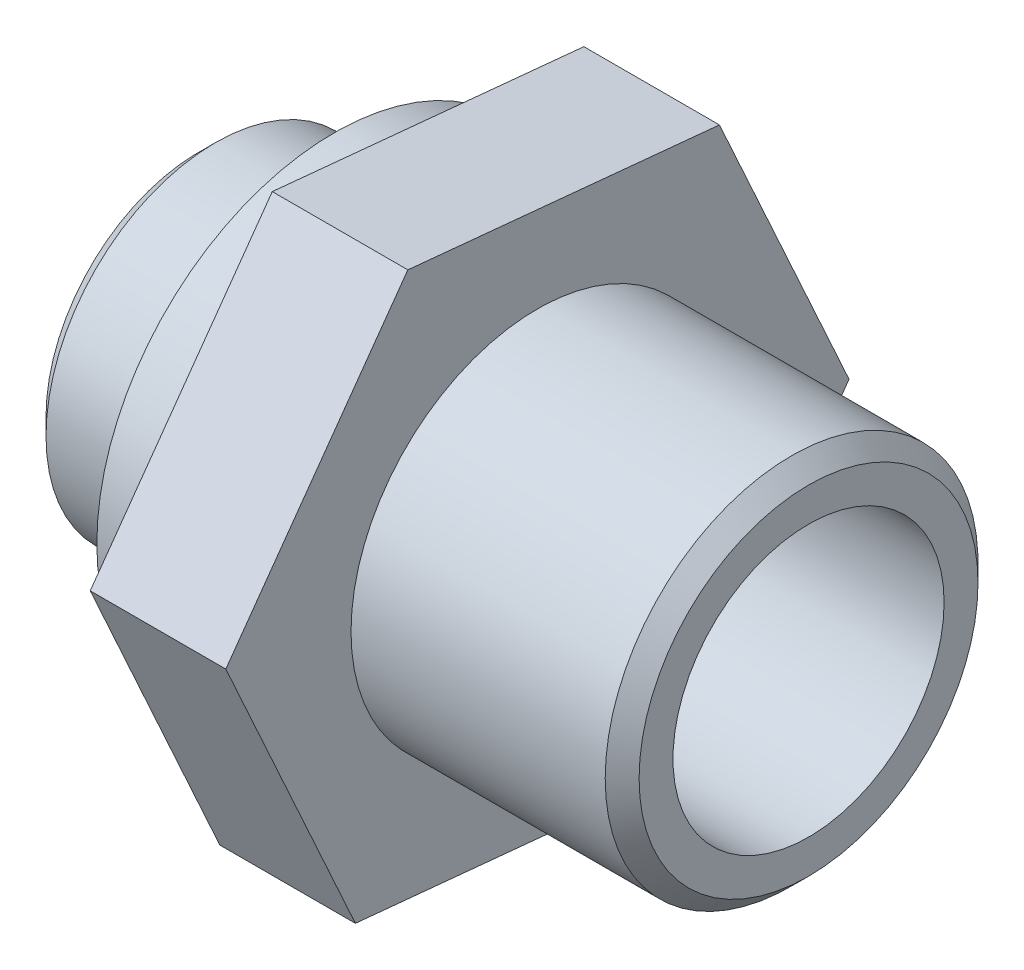
ISO-10303-21;
HEADER;
FILE_DESCRIPTION(('STEP AP214'),'2;1');
FILE_NAME('part.step','',(''),(''),'','','');
FILE_SCHEMA(('AUTOMOTIVE_DESIGN { 1 0 10303 214 1 1 1 1 }'));
ENDSEC;
DATA;
#1=APPLICATION_CONTEXT('core data for automotive mechanical design processes');
#2=APPLICATION_PROTOCOL_DEFINITION('international standard','automotive_design',2000,#1);
#3=PRODUCT_CONTEXT('',#1,'mechanical');
#4=PRODUCT('Part','Part','',(#3));
#5=PRODUCT_RELATED_PRODUCT_CATEGORY('part','',(#4));
#6=PRODUCT_DEFINITION_FORMATION('','',#4);
#7=PRODUCT_DEFINITION_CONTEXT('part definition',#1,'design');
#8=PRODUCT_DEFINITION('design','',#6,#7);
#9=PRODUCT_DEFINITION_SHAPE('','',#8);
#10=(LENGTH_UNIT() NAMED_UNIT(*) SI_UNIT(.MILLI.,.METRE.));
#11=(NAMED_UNIT(*) PLANE_ANGLE_UNIT() SI_UNIT($,.RADIAN.));
#12=(NAMED_UNIT(*) SI_UNIT($,.STERADIAN.) SOLID_ANGLE_UNIT());
#13=UNCERTAINTY_MEASURE_WITH_UNIT(LENGTH_MEASURE(1.E-05),#10,'distance_accuracy_value','');
#14=(GEOMETRIC_REPRESENTATION_CONTEXT(3) GLOBAL_UNCERTAINTY_ASSIGNED_CONTEXT((#13)) GLOBAL_UNIT_ASSIGNED_CONTEXT((#10,
#11,#12)) REPRESENTATION_CONTEXT('',''));
#15=CARTESIAN_POINT('',(0.,0.,0.));
#16=DIRECTION('',(0.,0.,1.));
#17=DIRECTION('',(1.,0.,0.));
#18=AXIS2_PLACEMENT_3D('',#15,#16,#17);
#19=CARTESIAN_POINT('',(-2.5,-2.5,0.));
#20=DIRECTION('',(-1.,0.,0.));
#21=DIRECTION('',(0.,0.,1.));
#22=AXIS2_PLACEMENT_3D('',#19,#20,#21);
#23=PLANE('',#22);
#24=CARTESIAN_POINT('',(-2.5,0.,0.));
#25=DIRECTION('',(-1.,0.,0.));
#26=DIRECTION('',(0.,0.,1.));
#27=AXIS2_PLACEMENT_3D('',#24,#25,#26);
#28=CIRCLE('',#27,3.5);
#29=CARTESIAN_POINT('',(-2.5,0.,3.5));
#30=VERTEX_POINT('',#29);
#31=EDGE_CURVE('E11',#30,#30,#28,.T.);
#32=ORIENTED_EDGE('',*,*,#31,.T.);
#33=EDGE_LOOP('',(#32));
#34=FACE_BOUND('',#33,.T.);
#35=CARTESIAN_POINT('',(-2.5,0.,0.));
#36=DIRECTION('',(-1.,0.,0.));
#37=DIRECTION('',(0.,0.,1.));
#38=AXIS2_PLACEMENT_3D('',#35,#36,#37);
#39=CIRCLE('',#38,2.5);
#40=CARTESIAN_POINT('',(-2.5,0.,2.5));
#41=VERTEX_POINT('',#40);
#42=EDGE_CURVE('E166',#41,#41,#39,.T.);
#43=ORIENTED_EDGE('',*,*,#42,.F.);
#44=EDGE_LOOP('',(#43));
#45=FACE_BOUND('',#44,.T.);
#46=ADVANCED_FACE('F44',(#34,#45),#23,.T.);
#47=CARTESIAN_POINT('',(-4.5,0.,0.));
#48=DIRECTION('',(-1.,0.,0.));
#49=DIRECTION('',(0.,0.,1.));
#50=AXIS2_PLACEMENT_3D('',#47,#48,#49);
#51=CYLINDRICAL_SURFACE('',#50,3.5);
#52=CARTESIAN_POINT('',(-1.5,0.,0.));
#53=DIRECTION('',(-1.,0.,0.));
#54=DIRECTION('',(0.,0.,1.));
#55=AXIS2_PLACEMENT_3D('',#52,#53,#54);
#56=CIRCLE('',#55,3.5);
#57=CARTESIAN_POINT('',(-1.5,0.,3.5));
#58=VERTEX_POINT('',#57);
#59=EDGE_CURVE('E165',#58,#58,#56,.T.);
#60=ORIENTED_EDGE('',*,*,#59,.T.);
#61=EDGE_LOOP('',(#60));
#62=FACE_BOUND('',#61,.T.);
#63=ORIENTED_EDGE('',*,*,#31,.F.);
#64=EDGE_LOOP('',(#63));
#65=FACE_BOUND('',#64,.T.);
#66=ADVANCED_FACE('F180',(#62,#65),#51,.T.);
#67=CARTESIAN_POINT('',(-4.5,0.,0.));
#68=DIRECTION('',(-1.,0.,0.));
#69=DIRECTION('',(0.,0.,1.));
#70=AXIS2_PLACEMENT_3D('',#67,#68,#69);
#71=PLANE('',#70);
#72=CARTESIAN_POINT('',(-4.5,0.,0.));
#73=DIRECTION('',(-1.,0.,0.));
#74=DIRECTION('',(0.,0.,1.));
#75=AXIS2_PLACEMENT_3D('',#72,#73,#74);
#76=CIRCLE('',#75,2.);
#77=CARTESIAN_POINT('',(-4.5,0.,2.));
#78=VERTEX_POINT('',#77);
#79=EDGE_CURVE('E424',#78,#78,#76,.T.);
#80=ORIENTED_EDGE('',*,*,#79,.F.);
#81=EDGE_LOOP('',(#80));
#82=FACE_BOUND('',#81,.T.);
#83=CARTESIAN_POINT('',(-4.5,0.,0.));
#84=DIRECTION('',(-1.,0.,0.));
#85=DIRECTION('',(0.,0.,1.));
#86=AXIS2_PLACEMENT_3D('',#83,#84,#85);
#87=CIRCLE('',#86,2.25);
#88=CARTESIAN_POINT('',(-4.5,0.,2.25));
#89=VERTEX_POINT('',#88);
#90=EDGE_CURVE('E53',#89,#89,#87,.T.);
#91=ORIENTED_EDGE('',*,*,#90,.T.);
#92=EDGE_LOOP('',(#91));
#93=FACE_BOUND('',#92,.T.);
#94=ADVANCED_FACE('F209',(#82,#93),#71,.T.);
#95=CARTESIAN_POINT('',(-4.5,0.,0.));
#96=DIRECTION('',(1.,0.,0.));
#97=DIRECTION('',(0.,0.,-1.));
#98=AXIS2_PLACEMENT_3D('',#95,#96,#97);
#99=CONICAL_SURFACE('',#98,2.25,0.785398163397446);
#100=CARTESIAN_POINT('',(-4.25,0.,0.));
#101=DIRECTION('',(-1.,0.,0.));
#102=DIRECTION('',(0.,0.,1.));
#103=AXIS2_PLACEMENT_3D('',#100,#101,#102);
#104=CIRCLE('',#103,2.5);
#105=CARTESIAN_POINT('',(-4.25,0.,2.5));
#106=VERTEX_POINT('',#105);
#107=EDGE_CURVE('E170',#106,#106,#104,.T.);
#108=ORIENTED_EDGE('',*,*,#107,.T.);
#109=EDGE_LOOP('',(#108));
#110=FACE_BOUND('',#109,.T.);
#111=ORIENTED_EDGE('',*,*,#90,.F.);
#112=EDGE_LOOP('',(#111));
#113=FACE_BOUND('',#112,.T.);
#114=ADVANCED_FACE('F217',(#110,#113),#99,.T.);
#115=CARTESIAN_POINT('',(-4.5,0.,0.));
#116=DIRECTION('',(-1.,0.,0.));
#117=DIRECTION('',(0.,0.,1.));
#118=AXIS2_PLACEMENT_3D('',#115,#116,#117);
#119=CYLINDRICAL_SURFACE('',#118,2.5);
#120=ORIENTED_EDGE('',*,*,#42,.T.);
#121=EDGE_LOOP('',(#120));
#122=FACE_BOUND('',#121,.T.);
#123=ORIENTED_EDGE('',*,*,#107,.F.);
#124=EDGE_LOOP('',(#123));
#125=FACE_BOUND('',#124,.T.);
#126=ADVANCED_FACE('F214',(#122,#125),#119,.T.);
#127=CARTESIAN_POINT('',(0.5,-3.75789570482405,2.68543352272929));
#128=DIRECTION('',(0.,0.995312151011748,-0.0967146423679853));
#129=DIRECTION('',(0.,0.0967146423679853,0.995312151011748));
#130=AXIS2_PLACEMENT_3D('',#127,#128,#129);
#131=PLANE('',#130);
#132=DIRECTION('',(0.,-0.0967146423679853,-0.995312151011748));
#133=VECTOR('',#132,1.);
#134=CARTESIAN_POINT('',(-1.5,-3.75789570482405,2.68543352272929));
#135=LINE('',#134,#133);
#136=CARTESIAN_POINT('',(-1.5,-3.75789570482405,2.68543352272929));
#137=VERTEX_POINT('',#136);
#138=CARTESIAN_POINT('',(-1.5,-4.20460150326993,-1.91171638378541));
#139=VERTEX_POINT('',#138);
#140=EDGE_CURVE('E134',#137,#139,#135,.T.);
#141=ORIENTED_EDGE('',*,*,#140,.T.);
#142=DIRECTION('',(-1.,0.,0.));
#143=VECTOR('',#142,1.);
#144=CARTESIAN_POINT('',(0.5,-4.20460150326993,-1.91171638378541));
#145=LINE('',#144,#143);
#146=CARTESIAN_POINT('',(0.5,-4.20460150326993,-1.91171638378541));
#147=VERTEX_POINT('',#146);
#148=EDGE_CURVE('E162',#147,#139,#145,.T.);
#149=ORIENTED_EDGE('',*,*,#148,.F.);
#150=DIRECTION('',(0.,-0.0967146423679853,-0.995312151011748));
#151=VECTOR('',#150,1.);
#152=CARTESIAN_POINT('',(0.5,-3.75789570482405,2.68543352272929));
#153=LINE('',#152,#151);
#154=CARTESIAN_POINT('',(0.5,-3.75789570482405,2.68543352272929));
#155=VERTEX_POINT('',#154);
#156=EDGE_CURVE('E151',#155,#147,#153,.T.);
#157=ORIENTED_EDGE('',*,*,#156,.F.);
#158=DIRECTION('',(-1.,0.,0.));
#159=VECTOR('',#158,1.);
#160=CARTESIAN_POINT('',(0.5,-3.75789570482405,2.68543352272929));
#161=LINE('',#160,#159);
#162=EDGE_CURVE('E130',#155,#137,#161,.T.);
#163=ORIENTED_EDGE('',*,*,#162,.T.);
#164=EDGE_LOOP('',(#141,#149,#157,#163));
#165=FACE_BOUND('',#164,.T.);
#166=ADVANCED_FACE('F192',(#165),#131,.F.);
#167=CARTESIAN_POINT('',(0.5,-4.20460150326993,-1.91171638378541));
#168=DIRECTION('',(0.,0.581413412714476,0.813608286287515));
#169=DIRECTION('',(0.,-0.813608286287515,0.581413412714476));
#170=AXIS2_PLACEMENT_3D('',#167,#168,#169);
#171=PLANE('',#170);
#172=DIRECTION('',(0.,0.813608286287515,-0.581413412714476));
#173=VECTOR('',#172,1.);
#174=CARTESIAN_POINT('',(-1.5,-4.20460150326993,-1.91171638378541));
#175=LINE('',#174,#173);
#176=CARTESIAN_POINT('',(-1.5,-0.446705798445874,-4.5971499065147));
#177=VERTEX_POINT('',#176);
#178=EDGE_CURVE('E138',#139,#177,#175,.T.);
#179=ORIENTED_EDGE('',*,*,#178,.T.);
#180=DIRECTION('',(-1.,0.,0.));
#181=VECTOR('',#180,1.);
#182=CARTESIAN_POINT('',(0.5,-0.446705798445874,-4.5971499065147));
#183=LINE('',#182,#181);
#184=CARTESIAN_POINT('',(0.5,-0.446705798445874,-4.5971499065147));
#185=VERTEX_POINT('',#184);
#186=EDGE_CURVE('E158',#185,#177,#183,.T.);
#187=ORIENTED_EDGE('',*,*,#186,.F.);
#188=DIRECTION('',(0.,0.813608286287515,-0.581413412714476));
#189=VECTOR('',#188,1.);
#190=CARTESIAN_POINT('',(0.5,-4.20460150326993,-1.91171638378541));
#191=LINE('',#190,#189);
#192=EDGE_CURVE('E99',#147,#185,#191,.T.);
#193=ORIENTED_EDGE('',*,*,#192,.F.);
#194=ORIENTED_EDGE('',*,*,#148,.T.);
#195=EDGE_LOOP('',(#179,#187,#193,#194));
#196=FACE_BOUND('',#195,.T.);
#197=ADVANCED_FACE('F235',(#196),#171,.F.);
#198=CARTESIAN_POINT('',(0.5,-0.446705798445874,-4.5971499065147));
#199=DIRECTION('',(0.,-0.413898738297272,0.9103229286555));
#200=DIRECTION('',(0.,-0.9103229286555,-0.413898738297272));
#201=AXIS2_PLACEMENT_3D('',#198,#199,#200);
#202=PLANE('',#201);
#203=DIRECTION('',(0.,0.9103229286555,0.413898738297272));
#204=VECTOR('',#203,1.);
#205=CARTESIAN_POINT('',(-1.5,-0.446705798445874,-4.5971499065147));
#206=LINE('',#205,#204);
#207=CARTESIAN_POINT('',(-1.5,3.75789570482405,-2.68543352272929));
#208=VERTEX_POINT('',#207);
#209=EDGE_CURVE('E142',#177,#208,#206,.T.);
#210=ORIENTED_EDGE('',*,*,#209,.T.);
#211=DIRECTION('',(-1.,0.,0.));
#212=VECTOR('',#211,1.);
#213=CARTESIAN_POINT('',(0.5,3.75789570482405,-2.68543352272929));
#214=LINE('',#213,#212);
#215=CARTESIAN_POINT('',(0.5,3.75789570482405,-2.68543352272929));
#216=VERTEX_POINT('',#215);
#217=EDGE_CURVE('E123',#216,#208,#214,.T.);
#218=ORIENTED_EDGE('',*,*,#217,.F.);
#219=DIRECTION('',(0.,0.9103229286555,0.413898738297272));
#220=VECTOR('',#219,1.);
#221=CARTESIAN_POINT('',(0.5,-0.446705798445874,-4.5971499065147));
#222=LINE('',#221,#220);
#223=EDGE_CURVE('E112',#185,#216,#222,.T.);
#224=ORIENTED_EDGE('',*,*,#223,.F.);
#225=ORIENTED_EDGE('',*,*,#186,.T.);
#226=EDGE_LOOP('',(#210,#218,#224,#225));
#227=FACE_BOUND('',#226,.T.);
#228=ADVANCED_FACE('F238',(#227),#202,.F.);
#229=CARTESIAN_POINT('',(0.5,3.75789570482405,-2.68543352272929));
#230=DIRECTION('',(0.,-0.995312151011748,0.0967146423679853));
#231=DIRECTION('',(0.,-0.0967146423679853,-0.995312151011748));
#232=AXIS2_PLACEMENT_3D('',#229,#230,#231);
#233=PLANE('',#232);
#234=DIRECTION('',(0.,0.0967146423679853,0.995312151011748));
#235=VECTOR('',#234,1.);
#236=CARTESIAN_POINT('',(-1.5,3.75789570482405,-2.68543352272929));
#237=LINE('',#236,#235);
#238=CARTESIAN_POINT('',(-1.5,4.20460150326993,1.91171638378541));
#239=VERTEX_POINT('',#238);
#240=EDGE_CURVE('E121',#208,#239,#237,.T.);
#241=ORIENTED_EDGE('',*,*,#240,.T.);
#242=DIRECTION('',(-1.,0.,0.));
#243=VECTOR('',#242,1.);
#244=CARTESIAN_POINT('',(0.5,4.20460150326993,1.91171638378541));
#245=LINE('',#244,#243);
#246=CARTESIAN_POINT('',(0.5,4.20460150326993,1.91171638378541));
#247=VERTEX_POINT('',#246);
#248=EDGE_CURVE('E118',#247,#239,#245,.T.);
#249=ORIENTED_EDGE('',*,*,#248,.F.);
#250=DIRECTION('',(0.,0.0967146423679853,0.995312151011748));
#251=VECTOR('',#250,1.);
#252=CARTESIAN_POINT('',(0.5,3.75789570482405,-2.68543352272929));
#253=LINE('',#252,#251);
#254=EDGE_CURVE('E106',#216,#247,#253,.T.);
#255=ORIENTED_EDGE('',*,*,#254,.F.);
#256=ORIENTED_EDGE('',*,*,#217,.T.);
#257=EDGE_LOOP('',(#241,#249,#255,#256));
#258=FACE_BOUND('',#257,.T.);
#259=ADVANCED_FACE('F119',(#258),#233,.F.);
#260=CARTESIAN_POINT('',(0.5,4.20460150326993,1.91171638378541));
#261=DIRECTION('',(0.,-0.581413412714476,-0.813608286287515));
#262=DIRECTION('',(0.,0.813608286287515,-0.581413412714476));
#263=AXIS2_PLACEMENT_3D('',#260,#261,#262);
#264=PLANE('',#263);
#265=DIRECTION('',(0.,-0.813608286287515,0.581413412714476));
#266=VECTOR('',#265,1.);
#267=CARTESIAN_POINT('',(-1.5,4.20460150326993,1.91171638378541));
#268=LINE('',#267,#266);
#269=CARTESIAN_POINT('',(-1.5,0.446705798445877,4.59714990651471));
#270=VERTEX_POINT('',#269);
#271=EDGE_CURVE('E84',#239,#270,#268,.T.);
#272=ORIENTED_EDGE('',*,*,#271,.T.);
#273=DIRECTION('',(-1.,0.,0.));
#274=VECTOR('',#273,1.);
#275=CARTESIAN_POINT('',(0.5,0.446705798445877,4.59714990651471));
#276=LINE('',#275,#274);
#277=CARTESIAN_POINT('',(0.5,0.446705798445877,4.59714990651471));
#278=VERTEX_POINT('',#277);
#279=EDGE_CURVE('E124',#278,#270,#276,.T.);
#280=ORIENTED_EDGE('',*,*,#279,.F.);
#281=DIRECTION('',(0.,-0.813608286287515,0.581413412714476));
#282=VECTOR('',#281,1.);
#283=CARTESIAN_POINT('',(0.5,4.20460150326993,1.91171638378541));
#284=LINE('',#283,#282);
#285=EDGE_CURVE('E110',#247,#278,#284,.T.);
#286=ORIENTED_EDGE('',*,*,#285,.F.);
#287=ORIENTED_EDGE('',*,*,#248,.T.);
#288=EDGE_LOOP('',(#272,#280,#286,#287));
#289=FACE_BOUND('',#288,.T.);
#290=ADVANCED_FACE('F126',(#289),#264,.F.);
#291=CARTESIAN_POINT('',(0.5,0.446705798445877,4.59714990651471));
#292=DIRECTION('',(0.,0.413898738297272,-0.9103229286555));
#293=DIRECTION('',(0.,0.9103229286555,0.413898738297272));
#294=AXIS2_PLACEMENT_3D('',#291,#292,#293);
#295=PLANE('',#294);
#296=DIRECTION('',(0.,-0.9103229286555,-0.413898738297272));
#297=VECTOR('',#296,1.);
#298=CARTESIAN_POINT('',(-1.5,0.446705798445877,4.59714990651471));
#299=LINE('',#298,#297);
#300=EDGE_CURVE('E90',#270,#137,#299,.T.);
#301=ORIENTED_EDGE('',*,*,#300,.T.);
#302=ORIENTED_EDGE('',*,*,#162,.F.);
#303=DIRECTION('',(0.,-0.9103229286555,-0.413898738297272));
#304=VECTOR('',#303,1.);
#305=CARTESIAN_POINT('',(0.5,0.446705798445877,4.59714990651471));
#306=LINE('',#305,#304);
#307=EDGE_CURVE('E61',#278,#155,#306,.T.);
#308=ORIENTED_EDGE('',*,*,#307,.F.);
#309=ORIENTED_EDGE('',*,*,#279,.T.);
#310=EDGE_LOOP('',(#301,#302,#308,#309));
#311=FACE_BOUND('',#310,.T.);
#312=ADVANCED_FACE('F194',(#311),#295,.F.);
#313=CARTESIAN_POINT('',(0.5,0.,0.));
#314=DIRECTION('',(1.,0.,0.));
#315=DIRECTION('',(0.,0.,-1.));
#316=AXIS2_PLACEMENT_3D('',#313,#314,#315);
#317=PLANE('',#316);
#318=CARTESIAN_POINT('',(0.5,0.,0.));
#319=DIRECTION('',(-1.,0.,0.));
#320=DIRECTION('',(0.,0.,1.));
#321=AXIS2_PLACEMENT_3D('',#318,#319,#320);
#322=CIRCLE('',#321,2.75);
#323=CARTESIAN_POINT('',(0.5,0.,2.75));
#324=VERTEX_POINT('',#323);
#325=EDGE_CURVE('E431',#324,#324,#322,.T.);
#326=ORIENTED_EDGE('',*,*,#325,.T.);
#327=EDGE_LOOP('',(#326));
#328=FACE_BOUND('',#327,.T.);
#329=ORIENTED_EDGE('',*,*,#156,.T.);
#330=ORIENTED_EDGE('',*,*,#192,.T.);
#331=ORIENTED_EDGE('',*,*,#223,.T.);
#332=ORIENTED_EDGE('',*,*,#254,.T.);
#333=ORIENTED_EDGE('',*,*,#285,.T.);
#334=ORIENTED_EDGE('',*,*,#307,.T.);
#335=EDGE_LOOP('',(#329,#330,#331,#332,#333,#334));
#336=FACE_BOUND('',#335,.T.);
#337=ADVANCED_FACE('F108',(#328,#336),#317,.T.);
#338=CARTESIAN_POINT('',(-1.5,0.,0.));
#339=DIRECTION('',(1.,0.,0.));
#340=DIRECTION('',(0.,0.,-1.));
#341=AXIS2_PLACEMENT_3D('',#338,#339,#340);
#342=PLANE('',#341);
#343=ORIENTED_EDGE('',*,*,#59,.F.);
#344=EDGE_LOOP('',(#343));
#345=FACE_BOUND('',#344,.T.);
#346=ORIENTED_EDGE('',*,*,#140,.F.);
#347=ORIENTED_EDGE('',*,*,#300,.F.);
#348=ORIENTED_EDGE('',*,*,#271,.F.);
#349=ORIENTED_EDGE('',*,*,#240,.F.);
#350=ORIENTED_EDGE('',*,*,#209,.F.);
#351=ORIENTED_EDGE('',*,*,#178,.F.);
#352=EDGE_LOOP('',(#346,#347,#348,#349,#350,#351));
#353=FACE_BOUND('',#352,.T.);
#354=ADVANCED_FACE('F183',(#345,#353),#342,.F.);
#355=CARTESIAN_POINT('',(4.5,0.,0.));
#356=DIRECTION('',(1.,0.,0.));
#357=DIRECTION('',(0.,0.,-1.));
#358=AXIS2_PLACEMENT_3D('',#355,#356,#357);
#359=PLANE('',#358);
#360=CARTESIAN_POINT('',(4.5,0.,0.));
#361=DIRECTION('',(1.,0.,0.));
#362=DIRECTION('',(0.,0.,-1.));
#363=AXIS2_PLACEMENT_3D('',#360,#361,#362);
#364=CIRCLE('',#363,2.);
#365=CARTESIAN_POINT('',(4.5,0.,-2.));
#366=VERTEX_POINT('',#365);
#367=EDGE_CURVE('E427',#366,#366,#364,.T.);
#368=ORIENTED_EDGE('',*,*,#367,.F.);
#369=EDGE_LOOP('',(#368));
#370=FACE_BOUND('',#369,.T.);
#371=CARTESIAN_POINT('',(4.5,0.,0.));
#372=DIRECTION('',(-1.,0.,0.));
#373=DIRECTION('',(0.,0.,1.));
#374=AXIS2_PLACEMENT_3D('',#371,#372,#373);
#375=CIRCLE('',#374,2.5);
#376=CARTESIAN_POINT('',(4.5,0.,2.5));
#377=VERTEX_POINT('',#376);
#378=EDGE_CURVE('E139',#377,#377,#375,.T.);
#379=ORIENTED_EDGE('',*,*,#378,.F.);
#380=EDGE_LOOP('',(#379));
#381=FACE_BOUND('',#380,.T.);
#382=ADVANCED_FACE('F186',(#370,#381),#359,.T.);
#383=CARTESIAN_POINT('',(4.25,0.,0.));
#384=DIRECTION('',(-1.,0.,0.));
#385=DIRECTION('',(0.,0.,1.));
#386=AXIS2_PLACEMENT_3D('',#383,#384,#385);
#387=CONICAL_SURFACE('',#386,2.75,0.785398163397443);
#388=ORIENTED_EDGE('',*,*,#378,.T.);
#389=EDGE_LOOP('',(#388));
#390=FACE_BOUND('',#389,.T.);
#391=CARTESIAN_POINT('',(4.25,0.,0.));
#392=DIRECTION('',(-1.,0.,0.));
#393=DIRECTION('',(0.,0.,1.));
#394=AXIS2_PLACEMENT_3D('',#391,#392,#393);
#395=CIRCLE('',#394,2.75);
#396=CARTESIAN_POINT('',(4.25,0.,2.75));
#397=VERTEX_POINT('',#396);
#398=EDGE_CURVE('E437',#397,#397,#395,.T.);
#399=ORIENTED_EDGE('',*,*,#398,.F.);
#400=EDGE_LOOP('',(#399));
#401=FACE_BOUND('',#400,.T.);
#402=ADVANCED_FACE('F277',(#390,#401),#387,.T.);
#403=CARTESIAN_POINT('',(-4.5,0.,0.));
#404=DIRECTION('',(-1.,0.,0.));
#405=DIRECTION('',(0.,0.,1.));
#406=AXIS2_PLACEMENT_3D('',#403,#404,#405);
#407=CYLINDRICAL_SURFACE('',#406,2.75);
#408=ORIENTED_EDGE('',*,*,#398,.T.);
#409=EDGE_LOOP('',(#408));
#410=FACE_BOUND('',#409,.T.);
#411=ORIENTED_EDGE('',*,*,#325,.F.);
#412=EDGE_LOOP('',(#411));
#413=FACE_BOUND('',#412,.T.);
#414=ADVANCED_FACE('F288',(#410,#413),#407,.T.);
#415=CARTESIAN_POINT('',(-5.5,0.,0.));
#416=DIRECTION('',(1.,0.,0.));
#417=DIRECTION('',(0.,0.,-1.));
#418=AXIS2_PLACEMENT_3D('',#415,#416,#417);
#419=CYLINDRICAL_SURFACE('',#418,2.);
#420=ORIENTED_EDGE('',*,*,#79,.T.);
#421=EDGE_LOOP('',(#420));
#422=FACE_BOUND('',#421,.T.);
#423=ORIENTED_EDGE('',*,*,#367,.T.);
#424=EDGE_LOOP('',(#423));
#425=FACE_BOUND('',#424,.T.);
#426=ADVANCED_FACE('F298',(#422,#425),#419,.F.);
#427=CLOSED_SHELL('',(#46,#66,#94,#114,#126,#166,#197,#228,#259,#290,#312,#337,#354,#382,#402,
#414,#426));
#428=MANIFOLD_SOLID_BREP('B2',#427);
#429=ADVANCED_BREP_SHAPE_REPRESENTATION('',(#18,#428),#14);
#430=SHAPE_DEFINITION_REPRESENTATION(#9,#429);
ENDSEC;
END-ISO-10303-21;
